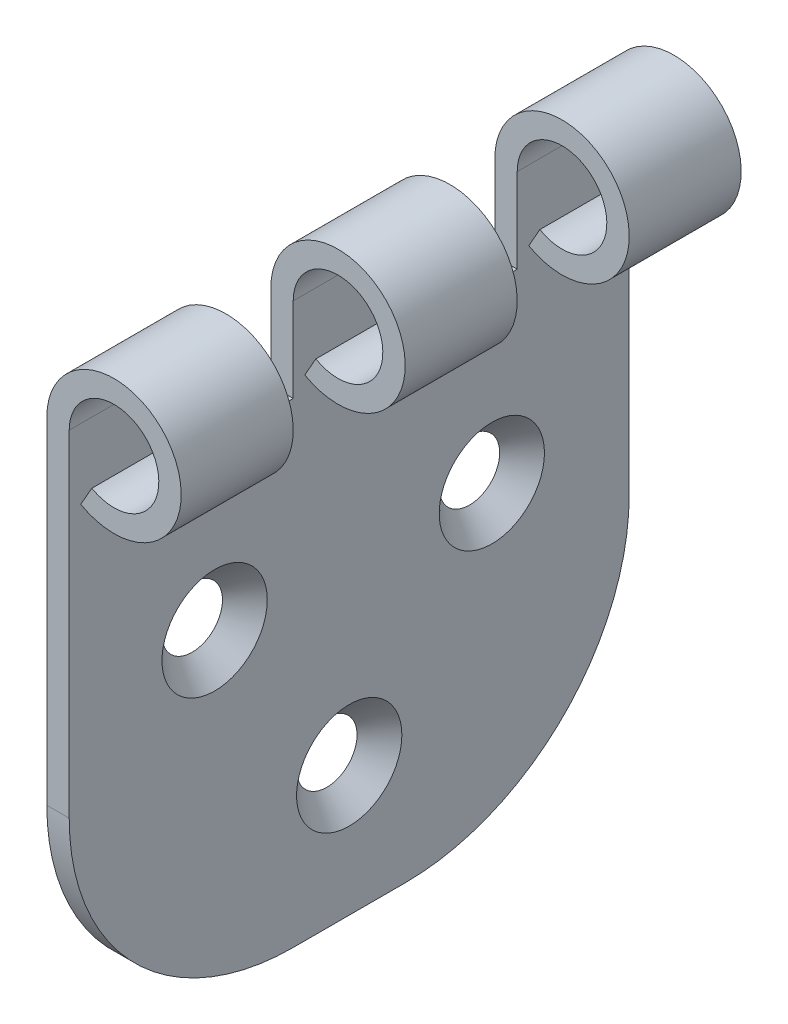
ISO-10303-21;
HEADER;
FILE_DESCRIPTION(('STEP AP214'),'2;1');
FILE_NAME('part.step','',(''),(''),'','','');
FILE_SCHEMA(('AUTOMOTIVE_DESIGN { 1 0 10303 214 1 1 1 1 }'));
ENDSEC;
DATA;
#1=APPLICATION_CONTEXT('core data for automotive mechanical design processes');
#2=APPLICATION_PROTOCOL_DEFINITION('international standard','automotive_design',2000,#1);
#3=PRODUCT_CONTEXT('',#1,'mechanical');
#4=PRODUCT('Part','Part','',(#3));
#5=PRODUCT_RELATED_PRODUCT_CATEGORY('part','',(#4));
#6=PRODUCT_DEFINITION_FORMATION('','',#4);
#7=PRODUCT_DEFINITION_CONTEXT('part definition',#1,'design');
#8=PRODUCT_DEFINITION('design','',#6,#7);
#9=PRODUCT_DEFINITION_SHAPE('','',#8);
#10=(LENGTH_UNIT() NAMED_UNIT(*) SI_UNIT(.MILLI.,.METRE.));
#11=(NAMED_UNIT(*) PLANE_ANGLE_UNIT() SI_UNIT($,.RADIAN.));
#12=(NAMED_UNIT(*) SI_UNIT($,.STERADIAN.) SOLID_ANGLE_UNIT());
#13=UNCERTAINTY_MEASURE_WITH_UNIT(LENGTH_MEASURE(1.E-05),#10,'distance_accuracy_value','');
#14=(GEOMETRIC_REPRESENTATION_CONTEXT(3) GLOBAL_UNCERTAINTY_ASSIGNED_CONTEXT((#13)) GLOBAL_UNIT_ASSIGNED_CONTEXT((#10,
#11,#12)) REPRESENTATION_CONTEXT('',''));
#15=CARTESIAN_POINT('',(0.,0.,0.));
#16=DIRECTION('',(0.,0.,1.));
#17=DIRECTION('',(1.,0.,0.));
#18=AXIS2_PLACEMENT_3D('',#15,#16,#17);
#19=CARTESIAN_POINT('',(1.99999999999999,50.,25.));
#20=DIRECTION('',(-1.,0.,0.));
#21=DIRECTION('',(0.,-1.,0.));
#22=AXIS2_PLACEMENT_3D('',#19,#20,#21);
#23=PLANE('',#22);
#24=CARTESIAN_POINT('',(2.,28.0397626935268,12.0173285585912));
#25=DIRECTION('',(1.,0.,0.));
#26=DIRECTION('',(0.,0.,-1.));
#27=AXIS2_PLACEMENT_3D('',#24,#25,#26);
#28=CIRCLE('',#27,4.7);
#29=CARTESIAN_POINT('',(2.,28.0397626935268,7.3173285585912));
#30=VERTEX_POINT('',#29);
#31=EDGE_CURVE('E241',#30,#30,#28,.T.);
#32=ORIENTED_EDGE('',*,*,#31,.F.);
#33=EDGE_LOOP('',(#32));
#34=FACE_BOUND('',#33,.T.);
#35=CARTESIAN_POINT('',(2.,27.0383186469775,-12.7326457346978));
#36=DIRECTION('',(1.,0.,0.));
#37=DIRECTION('',(0.,0.,-1.));
#38=AXIS2_PLACEMENT_3D('',#35,#36,#37);
#39=CIRCLE('',#38,4.7);
#40=CARTESIAN_POINT('',(2.,27.0383186469775,-17.4326457346978));
#41=VERTEX_POINT('',#40);
#42=EDGE_CURVE('E230',#41,#41,#39,.T.);
#43=ORIENTED_EDGE('',*,*,#42,.F.);
#44=EDGE_LOOP('',(#43));
#45=FACE_BOUND('',#44,.T.);
#46=DIRECTION('',(0.,0.,-1.));
#47=VECTOR('',#46,1.);
#48=CARTESIAN_POINT('',(2.,0.,25.));
#49=LINE('',#48,#47);
#50=CARTESIAN_POINT('',(2.,0.,5.));
#51=VERTEX_POINT('',#50);
#52=CARTESIAN_POINT('',(2.,0.,-5.));
#53=VERTEX_POINT('',#52);
#54=EDGE_CURVE('E215',#51,#53,#49,.T.);
#55=ORIENTED_EDGE('',*,*,#54,.T.);
#56=CARTESIAN_POINT('',(2.,20.,-5.));
#57=DIRECTION('',(-1.,0.,0.));
#58=DIRECTION('',(0.,-1.,0.));
#59=AXIS2_PLACEMENT_3D('',#56,#57,#58);
#60=CIRCLE('',#59,20.);
#61=CARTESIAN_POINT('',(2.,20.,-25.));
#62=VERTEX_POINT('',#61);
#63=EDGE_CURVE('E223',#53,#62,#60,.F.);
#64=ORIENTED_EDGE('',*,*,#63,.T.);
#65=DIRECTION('',(0.,1.,0.));
#66=VECTOR('',#65,1.);
#67=CARTESIAN_POINT('',(1.99999999999999,50.,-25.));
#68=LINE('',#67,#66);
#69=CARTESIAN_POINT('',(1.99999999999999,50.,-25.));
#70=VERTEX_POINT('',#69);
#71=EDGE_CURVE('E286',#62,#70,#68,.T.);
#72=ORIENTED_EDGE('',*,*,#71,.T.);
#73=DIRECTION('',(0.,0.,-1.));
#74=VECTOR('',#73,1.);
#75=CARTESIAN_POINT('',(1.99999999999999,50.,25.));
#76=LINE('',#75,#74);
#77=CARTESIAN_POINT('',(1.99999999999999,50.,-15.));
#78=VERTEX_POINT('',#77);
#79=EDGE_CURVE('E324',#78,#70,#76,.T.);
#80=ORIENTED_EDGE('',*,*,#79,.F.);
#81=DIRECTION('',(0.,1.,0.));
#82=VECTOR('',#81,1.);
#83=CARTESIAN_POINT('',(1.99999999999999,50.,-15.));
#84=LINE('',#83,#82);
#85=CARTESIAN_POINT('',(1.99999999999999,42.4546694492504,-15.));
#86=VERTEX_POINT('',#85);
#87=EDGE_CURVE('E257',#86,#78,#84,.T.);
#88=ORIENTED_EDGE('',*,*,#87,.F.);
#89=DIRECTION('',(0.,0.,-1.));
#90=VECTOR('',#89,1.);
#91=CARTESIAN_POINT('',(1.99999999999999,42.4546694492504,25.));
#92=LINE('',#91,#90);
#93=CARTESIAN_POINT('',(1.99999999999999,42.4546694492504,-5.));
#94=VERTEX_POINT('',#93);
#95=EDGE_CURVE('E259',#94,#86,#92,.T.);
#96=ORIENTED_EDGE('',*,*,#95,.F.);
#97=DIRECTION('',(0.,-1.,0.));
#98=VECTOR('',#97,1.);
#99=CARTESIAN_POINT('',(1.99999999999999,50.,-5.));
#100=LINE('',#99,#98);
#101=CARTESIAN_POINT('',(1.99999999999999,50.,-5.));
#102=VERTEX_POINT('',#101);
#103=EDGE_CURVE('E267',#102,#94,#100,.T.);
#104=ORIENTED_EDGE('',*,*,#103,.F.);
#105=CARTESIAN_POINT('',(1.99999999999999,50.,5.));
#106=VERTEX_POINT('',#105);
#107=EDGE_CURVE('E328',#106,#102,#76,.T.);
#108=ORIENTED_EDGE('',*,*,#107,.F.);
#109=DIRECTION('',(0.,1.,0.));
#110=VECTOR('',#109,1.);
#111=CARTESIAN_POINT('',(1.99999999999999,50.,5.));
#112=LINE('',#111,#110);
#113=CARTESIAN_POINT('',(1.99999999999999,42.4546694492504,5.));
#114=VERTEX_POINT('',#113);
#115=EDGE_CURVE('E275',#114,#106,#112,.T.);
#116=ORIENTED_EDGE('',*,*,#115,.F.);
#117=DIRECTION('',(0.,0.,-1.));
#118=VECTOR('',#117,1.);
#119=CARTESIAN_POINT('',(1.99999999999999,42.4546694492504,25.));
#120=LINE('',#119,#118);
#121=CARTESIAN_POINT('',(1.99999999999999,42.4546694492504,15.));
#122=VERTEX_POINT('',#121);
#123=EDGE_CURVE('E277',#122,#114,#120,.T.);
#124=ORIENTED_EDGE('',*,*,#123,.F.);
#125=DIRECTION('',(0.,-1.,0.));
#126=VECTOR('',#125,1.);
#127=CARTESIAN_POINT('',(1.99999999999999,50.,15.));
#128=LINE('',#127,#126);
#129=CARTESIAN_POINT('',(1.99999999999999,50.,15.));
#130=VERTEX_POINT('',#129);
#131=EDGE_CURVE('E191',#130,#122,#128,.T.);
#132=ORIENTED_EDGE('',*,*,#131,.F.);
#133=CARTESIAN_POINT('',(1.99999999999999,50.,25.));
#134=VERTEX_POINT('',#133);
#135=EDGE_CURVE('E326',#134,#130,#76,.T.);
#136=ORIENTED_EDGE('',*,*,#135,.F.);
#137=DIRECTION('',(0.,1.,0.));
#138=VECTOR('',#137,1.);
#139=CARTESIAN_POINT('',(1.99999999999999,50.,25.));
#140=LINE('',#139,#138);
#141=CARTESIAN_POINT('',(2.,20.,25.));
#142=VERTEX_POINT('',#141);
#143=EDGE_CURVE('E287',#142,#134,#140,.T.);
#144=ORIENTED_EDGE('',*,*,#143,.F.);
#145=CARTESIAN_POINT('',(2.,20.,5.));
#146=DIRECTION('',(-1.,0.,0.));
#147=DIRECTION('',(0.,-1.,0.));
#148=AXIS2_PLACEMENT_3D('',#145,#146,#147);
#149=CIRCLE('',#148,20.);
#150=EDGE_CURVE('E221',#142,#51,#149,.F.);
#151=ORIENTED_EDGE('',*,*,#150,.T.);
#152=EDGE_LOOP('',(#55,#64,#72,#80,#88,#96,#104,#108,#116,#124,#132,#136,#144,#151));
#153=FACE_BOUND('',#152,.T.);
#154=CARTESIAN_POINT('',(2.,11.5874676430746,0.));
#155=DIRECTION('',(1.,0.,0.));
#156=DIRECTION('',(0.,0.,-1.));
#157=AXIS2_PLACEMENT_3D('',#154,#155,#156);
#158=CIRCLE('',#157,4.7);
#159=CARTESIAN_POINT('',(2.,11.5874676430746,-4.7));
#160=VERTEX_POINT('',#159);
#161=EDGE_CURVE('E545',#160,#160,#158,.T.);
#162=ORIENTED_EDGE('',*,*,#161,.F.);
#163=EDGE_LOOP('',(#162));
#164=FACE_BOUND('',#163,.T.);
#165=ADVANCED_FACE('F41',(#34,#45,#153,#164),#23,.F.);
#166=CARTESIAN_POINT('',(0.,0.,25.));
#167=DIRECTION('',(1.,0.,0.));
#168=DIRECTION('',(0.,0.,-1.));
#169=AXIS2_PLACEMENT_3D('',#166,#167,#168);
#170=PLANE('',#169);
#171=CARTESIAN_POINT('',(0.,11.5874676430746,0.));
#172=DIRECTION('',(1.,0.,0.));
#173=DIRECTION('',(0.,0.,-1.));
#174=AXIS2_PLACEMENT_3D('',#171,#172,#173);
#175=CIRCLE('',#174,2.7);
#176=CARTESIAN_POINT('',(0.,11.5874676430746,-2.7));
#177=VERTEX_POINT('',#176);
#178=EDGE_CURVE('E548',#177,#177,#175,.T.);
#179=ORIENTED_EDGE('',*,*,#178,.T.);
#180=EDGE_LOOP('',(#179));
#181=FACE_BOUND('',#180,.T.);
#182=CARTESIAN_POINT('',(0.,28.0397626935268,12.0173285585912));
#183=DIRECTION('',(1.,0.,0.));
#184=DIRECTION('',(0.,0.,-1.));
#185=AXIS2_PLACEMENT_3D('',#182,#183,#184);
#186=CIRCLE('',#185,2.7);
#187=CARTESIAN_POINT('',(0.,28.0397626935268,9.3173285585912));
#188=VERTEX_POINT('',#187);
#189=EDGE_CURVE('E45',#188,#188,#186,.T.);
#190=ORIENTED_EDGE('',*,*,#189,.T.);
#191=EDGE_LOOP('',(#190));
#192=FACE_BOUND('',#191,.T.);
#193=CARTESIAN_POINT('',(0.,27.0383186469775,-12.7326457346978));
#194=DIRECTION('',(1.,0.,0.));
#195=DIRECTION('',(0.,0.,-1.));
#196=AXIS2_PLACEMENT_3D('',#193,#194,#195);
#197=CIRCLE('',#196,2.7);
#198=CARTESIAN_POINT('',(0.,27.0383186469775,-15.4326457346978));
#199=VERTEX_POINT('',#198);
#200=EDGE_CURVE('E227',#199,#199,#197,.T.);
#201=ORIENTED_EDGE('',*,*,#200,.T.);
#202=EDGE_LOOP('',(#201));
#203=FACE_BOUND('',#202,.T.);
#204=DIRECTION('',(0.,-1.,0.));
#205=VECTOR('',#204,1.);
#206=CARTESIAN_POINT('',(0.,0.,-25.));
#207=LINE('',#206,#205);
#208=CARTESIAN_POINT('',(0.,50.,-25.));
#209=VERTEX_POINT('',#208);
#210=CARTESIAN_POINT('',(0.,20.,-25.));
#211=VERTEX_POINT('',#210);
#212=EDGE_CURVE('E290',#209,#211,#207,.T.);
#213=ORIENTED_EDGE('',*,*,#212,.T.);
#214=CARTESIAN_POINT('',(0.,20.,-5.));
#215=DIRECTION('',(1.,0.,0.));
#216=DIRECTION('',(0.,0.,-1.));
#217=AXIS2_PLACEMENT_3D('',#214,#215,#216);
#218=CIRCLE('',#217,20.);
#219=CARTESIAN_POINT('',(0.,0.,-5.));
#220=VERTEX_POINT('',#219);
#221=EDGE_CURVE('E50',#211,#220,#218,.F.);
#222=ORIENTED_EDGE('',*,*,#221,.T.);
#223=DIRECTION('',(0.,0.,-1.));
#224=VECTOR('',#223,1.);
#225=CARTESIAN_POINT('',(0.,0.,25.));
#226=LINE('',#225,#224);
#227=CARTESIAN_POINT('',(0.,0.,5.));
#228=VERTEX_POINT('',#227);
#229=EDGE_CURVE('E298',#228,#220,#226,.T.);
#230=ORIENTED_EDGE('',*,*,#229,.F.);
#231=CARTESIAN_POINT('',(0.,20.,5.));
#232=DIRECTION('',(1.,0.,0.));
#233=DIRECTION('',(0.,0.,-1.));
#234=AXIS2_PLACEMENT_3D('',#231,#232,#233);
#235=CIRCLE('',#234,20.);
#236=CARTESIAN_POINT('',(0.,20.,25.));
#237=VERTEX_POINT('',#236);
#238=EDGE_CURVE('E58',#228,#237,#235,.F.);
#239=ORIENTED_EDGE('',*,*,#238,.T.);
#240=DIRECTION('',(0.,-1.,0.));
#241=VECTOR('',#240,1.);
#242=CARTESIAN_POINT('',(0.,0.,25.));
#243=LINE('',#242,#241);
#244=CARTESIAN_POINT('',(0.,50.,25.));
#245=VERTEX_POINT('',#244);
#246=EDGE_CURVE('E296',#245,#237,#243,.T.);
#247=ORIENTED_EDGE('',*,*,#246,.F.);
#248=DIRECTION('',(0.,0.,-1.));
#249=VECTOR('',#248,1.);
#250=CARTESIAN_POINT('',(0.,50.,25.));
#251=LINE('',#250,#249);
#252=CARTESIAN_POINT('',(0.,50.,15.));
#253=VERTEX_POINT('',#252);
#254=EDGE_CURVE('E208',#245,#253,#251,.T.);
#255=ORIENTED_EDGE('',*,*,#254,.T.);
#256=DIRECTION('',(0.,1.,0.));
#257=VECTOR('',#256,1.);
#258=CARTESIAN_POINT('',(0.,0.,15.));
#259=LINE('',#258,#257);
#260=CARTESIAN_POINT('',(0.,42.4546694492504,15.));
#261=VERTEX_POINT('',#260);
#262=EDGE_CURVE('E188',#261,#253,#259,.T.);
#263=ORIENTED_EDGE('',*,*,#262,.F.);
#264=DIRECTION('',(0.,0.,-1.));
#265=VECTOR('',#264,1.);
#266=CARTESIAN_POINT('',(0.,42.4546694492504,15.));
#267=LINE('',#266,#265);
#268=CARTESIAN_POINT('',(0.,42.4546694492504,5.));
#269=VERTEX_POINT('',#268);
#270=EDGE_CURVE('E198',#261,#269,#267,.T.);
#271=ORIENTED_EDGE('',*,*,#270,.T.);
#272=DIRECTION('',(0.,1.,0.));
#273=VECTOR('',#272,1.);
#274=CARTESIAN_POINT('',(0.,63.0450910057158,5.));
#275=LINE('',#274,#273);
#276=CARTESIAN_POINT('',(0.,50.,5.));
#277=VERTEX_POINT('',#276);
#278=EDGE_CURVE('E203',#269,#277,#275,.T.);
#279=ORIENTED_EDGE('',*,*,#278,.T.);
#280=CARTESIAN_POINT('',(0.,50.,-5.));
#281=VERTEX_POINT('',#280);
#282=EDGE_CURVE('E315',#277,#281,#251,.T.);
#283=ORIENTED_EDGE('',*,*,#282,.T.);
#284=DIRECTION('',(0.,1.,0.));
#285=VECTOR('',#284,1.);
#286=CARTESIAN_POINT('',(0.,0.,-5.));
#287=LINE('',#286,#285);
#288=CARTESIAN_POINT('',(0.,42.4546694492504,-5.));
#289=VERTEX_POINT('',#288);
#290=EDGE_CURVE('E210',#289,#281,#287,.T.);
#291=ORIENTED_EDGE('',*,*,#290,.F.);
#292=DIRECTION('',(0.,0.,-1.));
#293=VECTOR('',#292,1.);
#294=CARTESIAN_POINT('',(0.,42.4546694492504,-5.));
#295=LINE('',#294,#293);
#296=CARTESIAN_POINT('',(0.,42.4546694492504,-15.));
#297=VERTEX_POINT('',#296);
#298=EDGE_CURVE('E229',#289,#297,#295,.T.);
#299=ORIENTED_EDGE('',*,*,#298,.T.);
#300=DIRECTION('',(0.,1.,0.));
#301=VECTOR('',#300,1.);
#302=CARTESIAN_POINT('',(0.,63.0450910057158,-15.));
#303=LINE('',#302,#301);
#304=CARTESIAN_POINT('',(0.,50.,-15.));
#305=VERTEX_POINT('',#304);
#306=EDGE_CURVE('E234',#297,#305,#303,.T.);
#307=ORIENTED_EDGE('',*,*,#306,.T.);
#308=EDGE_CURVE('E312',#305,#209,#251,.T.);
#309=ORIENTED_EDGE('',*,*,#308,.T.);
#310=EDGE_LOOP('',(#213,#222,#230,#239,#247,#255,#263,#271,#279,#283,#291,#299,#307,#309));
#311=FACE_BOUND('',#310,.T.);
#312=ADVANCED_FACE('F206',(#181,#192,#203,#311),#170,.F.);
#313=CARTESIAN_POINT('',(6.,50.,25.));
#314=DIRECTION('',(0.,0.,-1.));
#315=DIRECTION('',(-1.,0.,0.));
#316=AXIS2_PLACEMENT_3D('',#313,#314,#315);
#317=CYLINDRICAL_SURFACE('',#316,4.00000000000001);
#318=CARTESIAN_POINT('',(6.,50.,15.));
#319=DIRECTION('',(0.,0.,-1.));
#320=DIRECTION('',(-1.,0.,0.));
#321=AXIS2_PLACEMENT_3D('',#318,#319,#320);
#322=CIRCLE('',#321,4.00000000000001);
#323=CARTESIAN_POINT('',(4.02184665664863,46.5233767316277,15.));
#324=VERTEX_POINT('',#323);
#325=EDGE_CURVE('E283',#324,#130,#322,.F.);
#326=ORIENTED_EDGE('',*,*,#325,.F.);
#327=DIRECTION('',(0.,0.,-1.));
#328=VECTOR('',#327,1.);
#329=CARTESIAN_POINT('',(4.02184665664862,46.5233767316277,25.));
#330=LINE('',#329,#328);
#331=CARTESIAN_POINT('',(4.02184665664862,46.5233767316277,25.));
#332=VERTEX_POINT('',#331);
#333=EDGE_CURVE('E321',#332,#324,#330,.T.);
#334=ORIENTED_EDGE('',*,*,#333,.F.);
#335=CARTESIAN_POINT('',(6.,50.,25.));
#336=DIRECTION('',(0.,0.,-1.));
#337=DIRECTION('',(1.,0.,0.));
#338=AXIS2_PLACEMENT_3D('',#335,#336,#337);
#339=CIRCLE('',#338,4.00000000000001);
#340=EDGE_CURVE('E289',#134,#332,#339,.T.);
#341=ORIENTED_EDGE('',*,*,#340,.F.);
#342=ORIENTED_EDGE('',*,*,#135,.T.);
#343=EDGE_LOOP('',(#326,#334,#341,#342));
#344=FACE_BOUND('',#343,.T.);
#345=ADVANCED_FACE('F347',(#344),#317,.F.);
#346=CARTESIAN_POINT('',(6.,50.,5.));
#347=DIRECTION('',(0.,0.,1.));
#348=DIRECTION('',(1.,0.,0.));
#349=AXIS2_PLACEMENT_3D('',#346,#347,#348);
#350=CIRCLE('',#349,4.00000000000001);
#351=CARTESIAN_POINT('',(4.02184665664863,46.5233767316277,5.));
#352=VERTEX_POINT('',#351);
#353=EDGE_CURVE('E273',#106,#352,#350,.F.);
#354=ORIENTED_EDGE('',*,*,#353,.F.);
#355=ORIENTED_EDGE('',*,*,#107,.T.);
#356=CARTESIAN_POINT('',(6.,50.,-5.));
#357=DIRECTION('',(0.,0.,-1.));
#358=DIRECTION('',(-1.,0.,0.));
#359=AXIS2_PLACEMENT_3D('',#356,#357,#358);
#360=CIRCLE('',#359,4.00000000000001);
#361=CARTESIAN_POINT('',(4.02184665664863,46.5233767316277,-5.));
#362=VERTEX_POINT('',#361);
#363=EDGE_CURVE('E265',#362,#102,#360,.F.);
#364=ORIENTED_EDGE('',*,*,#363,.F.);
#365=EDGE_CURVE('E325',#352,#362,#330,.T.);
#366=ORIENTED_EDGE('',*,*,#365,.F.);
#367=EDGE_LOOP('',(#354,#355,#364,#366));
#368=FACE_BOUND('',#367,.T.);
#369=ADVANCED_FACE('F418',(#368),#317,.F.);
#370=CARTESIAN_POINT('',(6.,50.,-15.));
#371=DIRECTION('',(0.,0.,1.));
#372=DIRECTION('',(1.,0.,0.));
#373=AXIS2_PLACEMENT_3D('',#370,#371,#372);
#374=CIRCLE('',#373,4.00000000000001);
#375=CARTESIAN_POINT('',(4.02184665664863,46.5233767316277,-15.));
#376=VERTEX_POINT('',#375);
#377=EDGE_CURVE('E255',#78,#376,#374,.F.);
#378=ORIENTED_EDGE('',*,*,#377,.F.);
#379=ORIENTED_EDGE('',*,*,#79,.T.);
#380=CARTESIAN_POINT('',(6.,50.,-25.));
#381=DIRECTION('',(0.,0.,-1.));
#382=DIRECTION('',(1.,0.,0.));
#383=AXIS2_PLACEMENT_3D('',#380,#381,#382);
#384=CIRCLE('',#383,4.00000000000001);
#385=CARTESIAN_POINT('',(4.02184665664862,46.5233767316277,-25.));
#386=VERTEX_POINT('',#385);
#387=EDGE_CURVE('E300',#70,#386,#384,.T.);
#388=ORIENTED_EDGE('',*,*,#387,.T.);
#389=EDGE_CURVE('E319',#376,#386,#330,.T.);
#390=ORIENTED_EDGE('',*,*,#389,.F.);
#391=EDGE_LOOP('',(#378,#379,#388,#390));
#392=FACE_BOUND('',#391,.T.);
#393=ADVANCED_FACE('F409',(#392),#317,.F.);
#394=CARTESIAN_POINT('',(3.03276998497294,44.7850650974415,25.));
#395=DIRECTION('',(0.869155817093078,-0.494538335837844,0.));
#396=DIRECTION('',(0.494538335837844,0.869155817093078,0.));
#397=AXIS2_PLACEMENT_3D('',#394,#395,#396);
#398=PLANE('',#397);
#399=DIRECTION('',(0.494538335837844,0.869155817093078,0.));
#400=VECTOR('',#399,1.);
#401=CARTESIAN_POINT('',(3.03276998497294,44.7850650974415,15.));
#402=LINE('',#401,#400);
#403=CARTESIAN_POINT('',(3.03276998497294,44.7850650974415,15.));
#404=VERTEX_POINT('',#403);
#405=EDGE_CURVE('E281',#404,#324,#402,.T.);
#406=ORIENTED_EDGE('',*,*,#405,.F.);
#407=DIRECTION('',(0.,0.,-1.));
#408=VECTOR('',#407,1.);
#409=CARTESIAN_POINT('',(3.03276998497294,44.7850650974415,25.));
#410=LINE('',#409,#408);
#411=CARTESIAN_POINT('',(3.03276998497294,44.7850650974415,25.));
#412=VERTEX_POINT('',#411);
#413=EDGE_CURVE('E316',#412,#404,#410,.T.);
#414=ORIENTED_EDGE('',*,*,#413,.F.);
#415=DIRECTION('',(-0.494538335837844,-0.869155817093078,0.));
#416=VECTOR('',#415,1.);
#417=CARTESIAN_POINT('',(3.03276998497294,44.7850650974415,25.));
#418=LINE('',#417,#416);
#419=EDGE_CURVE('E292',#332,#412,#418,.T.);
#420=ORIENTED_EDGE('',*,*,#419,.F.);
#421=ORIENTED_EDGE('',*,*,#333,.T.);
#422=EDGE_LOOP('',(#406,#414,#420,#421));
#423=FACE_BOUND('',#422,.T.);
#424=ADVANCED_FACE('F353',(#423),#398,.F.);
#425=DIRECTION('',(-0.494538335837844,-0.869155817093078,0.));
#426=VECTOR('',#425,1.);
#427=CARTESIAN_POINT('',(3.03276998497294,44.7850650974415,5.));
#428=LINE('',#427,#426);
#429=CARTESIAN_POINT('',(3.03276998497294,44.7850650974415,5.));
#430=VERTEX_POINT('',#429);
#431=EDGE_CURVE('E271',#352,#430,#428,.T.);
#432=ORIENTED_EDGE('',*,*,#431,.F.);
#433=ORIENTED_EDGE('',*,*,#365,.T.);
#434=DIRECTION('',(0.494538335837844,0.869155817093078,0.));
#435=VECTOR('',#434,1.);
#436=CARTESIAN_POINT('',(3.03276998497294,44.7850650974415,-5.));
#437=LINE('',#436,#435);
#438=CARTESIAN_POINT('',(3.03276998497294,44.7850650974415,-5.));
#439=VERTEX_POINT('',#438);
#440=EDGE_CURVE('E263',#439,#362,#437,.T.);
#441=ORIENTED_EDGE('',*,*,#440,.F.);
#442=EDGE_CURVE('E320',#430,#439,#410,.T.);
#443=ORIENTED_EDGE('',*,*,#442,.F.);
#444=EDGE_LOOP('',(#432,#433,#441,#443));
#445=FACE_BOUND('',#444,.T.);
#446=ADVANCED_FACE('F366',(#445),#398,.F.);
#447=DIRECTION('',(-0.494538335837844,-0.869155817093078,0.));
#448=VECTOR('',#447,1.);
#449=CARTESIAN_POINT('',(3.03276998497294,44.7850650974415,-15.));
#450=LINE('',#449,#448);
#451=CARTESIAN_POINT('',(3.03276998497294,44.7850650974415,-15.));
#452=VERTEX_POINT('',#451);
#453=EDGE_CURVE('E253',#376,#452,#450,.T.);
#454=ORIENTED_EDGE('',*,*,#453,.F.);
#455=ORIENTED_EDGE('',*,*,#389,.T.);
#456=DIRECTION('',(-0.494538335837844,-0.869155817093078,0.));
#457=VECTOR('',#456,1.);
#458=CARTESIAN_POINT('',(3.03276998497294,44.7850650974415,-25.));
#459=LINE('',#458,#457);
#460=CARTESIAN_POINT('',(3.03276998497294,44.7850650974415,-25.));
#461=VERTEX_POINT('',#460);
#462=EDGE_CURVE('E303',#386,#461,#459,.T.);
#463=ORIENTED_EDGE('',*,*,#462,.T.);
#464=EDGE_CURVE('E314',#452,#461,#410,.T.);
#465=ORIENTED_EDGE('',*,*,#464,.F.);
#466=EDGE_LOOP('',(#454,#455,#463,#465));
#467=FACE_BOUND('',#466,.T.);
#468=ADVANCED_FACE('F358',(#467),#398,.F.);
#469=CARTESIAN_POINT('',(6.,50.,25.));
#470=DIRECTION('',(0.,0.,-1.));
#471=DIRECTION('',(-1.,0.,0.));
#472=AXIS2_PLACEMENT_3D('',#469,#470,#471);
#473=CYLINDRICAL_SURFACE('',#472,6.);
#474=CARTESIAN_POINT('',(6.,50.,15.));
#475=DIRECTION('',(0.,0.,-1.));
#476=DIRECTION('',(-1.,0.,0.));
#477=AXIS2_PLACEMENT_3D('',#474,#475,#476);
#478=CIRCLE('',#477,6.);
#479=EDGE_CURVE('E279',#253,#404,#478,.T.);
#480=ORIENTED_EDGE('',*,*,#479,.F.);
#481=ORIENTED_EDGE('',*,*,#254,.F.);
#482=CARTESIAN_POINT('',(6.,50.,25.));
#483=DIRECTION('',(0.,0.,1.));
#484=DIRECTION('',(1.,0.,0.));
#485=AXIS2_PLACEMENT_3D('',#482,#483,#484);
#486=CIRCLE('',#485,6.);
#487=EDGE_CURVE('E294',#412,#245,#486,.T.);
#488=ORIENTED_EDGE('',*,*,#487,.F.);
#489=ORIENTED_EDGE('',*,*,#413,.T.);
#490=EDGE_LOOP('',(#480,#481,#488,#489));
#491=FACE_BOUND('',#490,.T.);
#492=ADVANCED_FACE('F355',(#491),#473,.T.);
#493=ORIENTED_EDGE('',*,*,#282,.F.);
#494=CARTESIAN_POINT('',(6.,50.,5.));
#495=DIRECTION('',(0.,0.,1.));
#496=DIRECTION('',(1.,0.,0.));
#497=AXIS2_PLACEMENT_3D('',#494,#495,#496);
#498=CIRCLE('',#497,6.);
#499=EDGE_CURVE('E269',#430,#277,#498,.T.);
#500=ORIENTED_EDGE('',*,*,#499,.F.);
#501=ORIENTED_EDGE('',*,*,#442,.T.);
#502=CARTESIAN_POINT('',(6.,50.,-5.));
#503=DIRECTION('',(0.,0.,-1.));
#504=DIRECTION('',(-1.,0.,0.));
#505=AXIS2_PLACEMENT_3D('',#502,#503,#504);
#506=CIRCLE('',#505,6.);
#507=EDGE_CURVE('E261',#281,#439,#506,.T.);
#508=ORIENTED_EDGE('',*,*,#507,.F.);
#509=EDGE_LOOP('',(#493,#500,#501,#508));
#510=FACE_BOUND('',#509,.T.);
#511=ADVANCED_FACE('F357',(#510),#473,.T.);
#512=ORIENTED_EDGE('',*,*,#308,.F.);
#513=CARTESIAN_POINT('',(6.,50.,-15.));
#514=DIRECTION('',(0.,0.,1.));
#515=DIRECTION('',(1.,0.,0.));
#516=AXIS2_PLACEMENT_3D('',#513,#514,#515);
#517=CIRCLE('',#516,6.);
#518=EDGE_CURVE('E194',#452,#305,#517,.T.);
#519=ORIENTED_EDGE('',*,*,#518,.F.);
#520=ORIENTED_EDGE('',*,*,#464,.T.);
#521=CARTESIAN_POINT('',(6.,50.,-25.));
#522=DIRECTION('',(0.,0.,1.));
#523=DIRECTION('',(1.,0.,0.));
#524=AXIS2_PLACEMENT_3D('',#521,#522,#523);
#525=CIRCLE('',#524,6.);
#526=EDGE_CURVE('E306',#461,#209,#525,.T.);
#527=ORIENTED_EDGE('',*,*,#526,.T.);
#528=EDGE_LOOP('',(#512,#519,#520,#527));
#529=FACE_BOUND('',#528,.T.);
#530=ADVANCED_FACE('F360',(#529),#473,.T.);
#531=CARTESIAN_POINT('',(2.,0.,25.));
#532=DIRECTION('',(0.,1.,0.));
#533=DIRECTION('',(-1.,0.,0.));
#534=AXIS2_PLACEMENT_3D('',#531,#532,#533);
#535=PLANE('',#534);
#536=ORIENTED_EDGE('',*,*,#229,.T.);
#537=DIRECTION('',(1.,0.,0.));
#538=VECTOR('',#537,1.);
#539=CARTESIAN_POINT('',(2.,0.,-5.));
#540=LINE('',#539,#538);
#541=EDGE_CURVE('E212',#220,#53,#540,.T.);
#542=ORIENTED_EDGE('',*,*,#541,.T.);
#543=ORIENTED_EDGE('',*,*,#54,.F.);
#544=DIRECTION('',(1.,0.,0.));
#545=VECTOR('',#544,1.);
#546=CARTESIAN_POINT('',(0.,0.,5.));
#547=LINE('',#546,#545);
#548=EDGE_CURVE('E209',#51,#228,#547,.F.);
#549=ORIENTED_EDGE('',*,*,#548,.T.);
#550=EDGE_LOOP('',(#536,#542,#543,#549));
#551=FACE_BOUND('',#550,.T.);
#552=ADVANCED_FACE('F336',(#551),#535,.F.);
#553=CARTESIAN_POINT('',(6.,50.,25.));
#554=DIRECTION('',(0.,0.,1.));
#555=DIRECTION('',(1.,0.,0.));
#556=AXIS2_PLACEMENT_3D('',#553,#554,#555);
#557=PLANE('',#556);
#558=ORIENTED_EDGE('',*,*,#246,.T.);
#559=DIRECTION('',(1.,0.,0.));
#560=VECTOR('',#559,1.);
#561=CARTESIAN_POINT('',(2.,20.,25.));
#562=LINE('',#561,#560);
#563=EDGE_CURVE('E11',#237,#142,#562,.T.);
#564=ORIENTED_EDGE('',*,*,#563,.T.);
#565=ORIENTED_EDGE('',*,*,#143,.T.);
#566=ORIENTED_EDGE('',*,*,#340,.T.);
#567=ORIENTED_EDGE('',*,*,#419,.T.);
#568=ORIENTED_EDGE('',*,*,#487,.T.);
#569=EDGE_LOOP('',(#558,#564,#565,#566,#567,#568));
#570=FACE_BOUND('',#569,.T.);
#571=ADVANCED_FACE('F341',(#570),#557,.T.);
#572=CARTESIAN_POINT('',(6.,50.,-25.));
#573=DIRECTION('',(0.,0.,1.));
#574=DIRECTION('',(1.,0.,0.));
#575=AXIS2_PLACEMENT_3D('',#572,#573,#574);
#576=PLANE('',#575);
#577=ORIENTED_EDGE('',*,*,#71,.F.);
#578=DIRECTION('',(1.,0.,0.));
#579=VECTOR('',#578,1.);
#580=CARTESIAN_POINT('',(6.,20.,-25.));
#581=LINE('',#580,#579);
#582=EDGE_CURVE('E66',#62,#211,#581,.F.);
#583=ORIENTED_EDGE('',*,*,#582,.T.);
#584=ORIENTED_EDGE('',*,*,#212,.F.);
#585=ORIENTED_EDGE('',*,*,#526,.F.);
#586=ORIENTED_EDGE('',*,*,#462,.F.);
#587=ORIENTED_EDGE('',*,*,#387,.F.);
#588=EDGE_LOOP('',(#577,#583,#584,#585,#586,#587));
#589=FACE_BOUND('',#588,.T.);
#590=ADVANCED_FACE('F399',(#589),#576,.F.);
#591=CARTESIAN_POINT('',(12.,63.0450910057158,-5.));
#592=DIRECTION('',(0.,0.,-1.));
#593=DIRECTION('',(-1.,0.,0.));
#594=AXIS2_PLACEMENT_3D('',#591,#592,#593);
#595=PLANE('',#594);
#596=ORIENTED_EDGE('',*,*,#103,.T.);
#597=DIRECTION('',(-1.,0.,0.));
#598=VECTOR('',#597,1.);
#599=CARTESIAN_POINT('',(12.,42.4546694492504,-5.));
#600=LINE('',#599,#598);
#601=EDGE_CURVE('E204',#94,#289,#600,.T.);
#602=ORIENTED_EDGE('',*,*,#601,.T.);
#603=ORIENTED_EDGE('',*,*,#290,.T.);
#604=ORIENTED_EDGE('',*,*,#507,.T.);
#605=ORIENTED_EDGE('',*,*,#440,.T.);
#606=ORIENTED_EDGE('',*,*,#363,.T.);
#607=EDGE_LOOP('',(#596,#602,#603,#604,#605,#606));
#608=FACE_BOUND('',#607,.T.);
#609=ADVANCED_FACE('F425',(#608),#595,.T.);
#610=CARTESIAN_POINT('',(12.,42.4546694492504,-5.));
#611=DIRECTION('',(0.,1.,0.));
#612=DIRECTION('',(-1.,0.,0.));
#613=AXIS2_PLACEMENT_3D('',#610,#611,#612);
#614=PLANE('',#613);
#615=ORIENTED_EDGE('',*,*,#95,.T.);
#616=DIRECTION('',(-1.,0.,0.));
#617=VECTOR('',#616,1.);
#618=CARTESIAN_POINT('',(12.,42.4546694492504,-15.));
#619=LINE('',#618,#617);
#620=EDGE_CURVE('E249',#86,#297,#619,.T.);
#621=ORIENTED_EDGE('',*,*,#620,.T.);
#622=ORIENTED_EDGE('',*,*,#298,.F.);
#623=ORIENTED_EDGE('',*,*,#601,.F.);
#624=EDGE_LOOP('',(#615,#621,#622,#623));
#625=FACE_BOUND('',#624,.T.);
#626=ADVANCED_FACE('F428',(#625),#614,.T.);
#627=CARTESIAN_POINT('',(12.,63.0450910057158,-15.));
#628=DIRECTION('',(0.,0.,1.));
#629=DIRECTION('',(1.,0.,0.));
#630=AXIS2_PLACEMENT_3D('',#627,#628,#629);
#631=PLANE('',#630);
#632=ORIENTED_EDGE('',*,*,#87,.T.);
#633=ORIENTED_EDGE('',*,*,#377,.T.);
#634=ORIENTED_EDGE('',*,*,#453,.T.);
#635=ORIENTED_EDGE('',*,*,#518,.T.);
#636=ORIENTED_EDGE('',*,*,#306,.F.);
#637=ORIENTED_EDGE('',*,*,#620,.F.);
#638=EDGE_LOOP('',(#632,#633,#634,#635,#636,#637));
#639=FACE_BOUND('',#638,.T.);
#640=ADVANCED_FACE('F510',(#639),#631,.T.);
#641=CARTESIAN_POINT('',(12.,63.0450910057158,15.));
#642=DIRECTION('',(0.,0.,-1.));
#643=DIRECTION('',(-1.,0.,0.));
#644=AXIS2_PLACEMENT_3D('',#641,#642,#643);
#645=PLANE('',#644);
#646=ORIENTED_EDGE('',*,*,#131,.T.);
#647=DIRECTION('',(-1.,0.,0.));
#648=VECTOR('',#647,1.);
#649=CARTESIAN_POINT('',(12.,42.4546694492504,15.));
#650=LINE('',#649,#648);
#651=EDGE_CURVE('E184',#122,#261,#650,.T.);
#652=ORIENTED_EDGE('',*,*,#651,.T.);
#653=ORIENTED_EDGE('',*,*,#262,.T.);
#654=ORIENTED_EDGE('',*,*,#479,.T.);
#655=ORIENTED_EDGE('',*,*,#405,.T.);
#656=ORIENTED_EDGE('',*,*,#325,.T.);
#657=EDGE_LOOP('',(#646,#652,#653,#654,#655,#656));
#658=FACE_BOUND('',#657,.T.);
#659=ADVANCED_FACE('F186',(#658),#645,.T.);
#660=CARTESIAN_POINT('',(12.,42.4546694492504,15.));
#661=DIRECTION('',(0.,1.,0.));
#662=DIRECTION('',(-1.,0.,0.));
#663=AXIS2_PLACEMENT_3D('',#660,#661,#662);
#664=PLANE('',#663);
#665=ORIENTED_EDGE('',*,*,#123,.T.);
#666=DIRECTION('',(-1.,0.,0.));
#667=VECTOR('',#666,1.);
#668=CARTESIAN_POINT('',(12.,42.4546694492504,5.));
#669=LINE('',#668,#667);
#670=EDGE_CURVE('E195',#114,#269,#669,.T.);
#671=ORIENTED_EDGE('',*,*,#670,.T.);
#672=ORIENTED_EDGE('',*,*,#270,.F.);
#673=ORIENTED_EDGE('',*,*,#651,.F.);
#674=EDGE_LOOP('',(#665,#671,#672,#673));
#675=FACE_BOUND('',#674,.T.);
#676=ADVANCED_FACE('F199',(#675),#664,.T.);
#677=CARTESIAN_POINT('',(12.,63.0450910057158,5.));
#678=DIRECTION('',(0.,0.,1.));
#679=DIRECTION('',(1.,0.,0.));
#680=AXIS2_PLACEMENT_3D('',#677,#678,#679);
#681=PLANE('',#680);
#682=ORIENTED_EDGE('',*,*,#115,.T.);
#683=ORIENTED_EDGE('',*,*,#353,.T.);
#684=ORIENTED_EDGE('',*,*,#431,.T.);
#685=ORIENTED_EDGE('',*,*,#499,.T.);
#686=ORIENTED_EDGE('',*,*,#278,.F.);
#687=ORIENTED_EDGE('',*,*,#670,.F.);
#688=EDGE_LOOP('',(#682,#683,#684,#685,#686,#687));
#689=FACE_BOUND('',#688,.T.);
#690=ADVANCED_FACE('F387',(#689),#681,.T.);
#691=CARTESIAN_POINT('',(2.,20.,-5.));
#692=DIRECTION('',(1.,0.,0.));
#693=DIRECTION('',(0.,1.,0.));
#694=AXIS2_PLACEMENT_3D('',#691,#692,#693);
#695=CYLINDRICAL_SURFACE('',#694,20.);
#696=ORIENTED_EDGE('',*,*,#221,.F.);
#697=ORIENTED_EDGE('',*,*,#582,.F.);
#698=ORIENTED_EDGE('',*,*,#63,.F.);
#699=ORIENTED_EDGE('',*,*,#541,.F.);
#700=EDGE_LOOP('',(#696,#697,#698,#699));
#701=FACE_BOUND('',#700,.T.);
#702=ADVANCED_FACE('F385',(#701),#695,.T.);
#703=CARTESIAN_POINT('',(6.,20.,5.));
#704=DIRECTION('',(-1.,0.,0.));
#705=DIRECTION('',(0.,-1.,0.));
#706=AXIS2_PLACEMENT_3D('',#703,#704,#705);
#707=CYLINDRICAL_SURFACE('',#706,20.);
#708=ORIENTED_EDGE('',*,*,#238,.F.);
#709=ORIENTED_EDGE('',*,*,#548,.F.);
#710=ORIENTED_EDGE('',*,*,#150,.F.);
#711=ORIENTED_EDGE('',*,*,#563,.F.);
#712=EDGE_LOOP('',(#708,#709,#710,#711));
#713=FACE_BOUND('',#712,.T.);
#714=ADVANCED_FACE('F43',(#713),#707,.T.);
#715=CARTESIAN_POINT('',(2.,27.0383186469775,-12.7326457346978));
#716=DIRECTION('',(1.,0.,0.));
#717=DIRECTION('',(0.,0.,-1.));
#718=AXIS2_PLACEMENT_3D('',#715,#716,#717);
#719=CONICAL_SURFACE('',#718,4.7,0.785398163397448);
#720=ORIENTED_EDGE('',*,*,#42,.T.);
#721=EDGE_LOOP('',(#720));
#722=FACE_BOUND('',#721,.T.);
#723=ORIENTED_EDGE('',*,*,#200,.F.);
#724=EDGE_LOOP('',(#723));
#725=FACE_BOUND('',#724,.T.);
#726=ADVANCED_FACE('F392',(#722,#725),#719,.F.);
#727=CARTESIAN_POINT('',(2.,28.0397626935268,12.0173285585912));
#728=DIRECTION('',(1.,0.,0.));
#729=DIRECTION('',(0.,0.,-1.));
#730=AXIS2_PLACEMENT_3D('',#727,#728,#729);
#731=CONICAL_SURFACE('',#730,4.7,0.785398163397448);
#732=ORIENTED_EDGE('',*,*,#31,.T.);
#733=EDGE_LOOP('',(#732));
#734=FACE_BOUND('',#733,.T.);
#735=ORIENTED_EDGE('',*,*,#189,.F.);
#736=EDGE_LOOP('',(#735));
#737=FACE_BOUND('',#736,.T.);
#738=ADVANCED_FACE('F533',(#734,#737),#731,.F.);
#739=CARTESIAN_POINT('',(2.,11.5874676430746,0.));
#740=DIRECTION('',(1.,0.,0.));
#741=DIRECTION('',(0.,0.,-1.));
#742=AXIS2_PLACEMENT_3D('',#739,#740,#741);
#743=CONICAL_SURFACE('',#742,4.7,0.785398163397448);
#744=ORIENTED_EDGE('',*,*,#161,.T.);
#745=EDGE_LOOP('',(#744));
#746=FACE_BOUND('',#745,.T.);
#747=ORIENTED_EDGE('',*,*,#178,.F.);
#748=EDGE_LOOP('',(#747));
#749=FACE_BOUND('',#748,.T.);
#750=ADVANCED_FACE('F536',(#746,#749),#743,.F.);
#751=CLOSED_SHELL('',(#165,#312,#345,#369,#393,#424,#446,#468,#492,#511,#530,#552,#571,#590,
#609,#626,#640,#659,#676,#690,#702,#714,#726,#738,#750));
#752=MANIFOLD_SOLID_BREP('B2',#751);
#753=ADVANCED_BREP_SHAPE_REPRESENTATION('',(#18,#752),#14);
#754=SHAPE_DEFINITION_REPRESENTATION(#9,#753);
ENDSEC;
END-ISO-10303-21;
